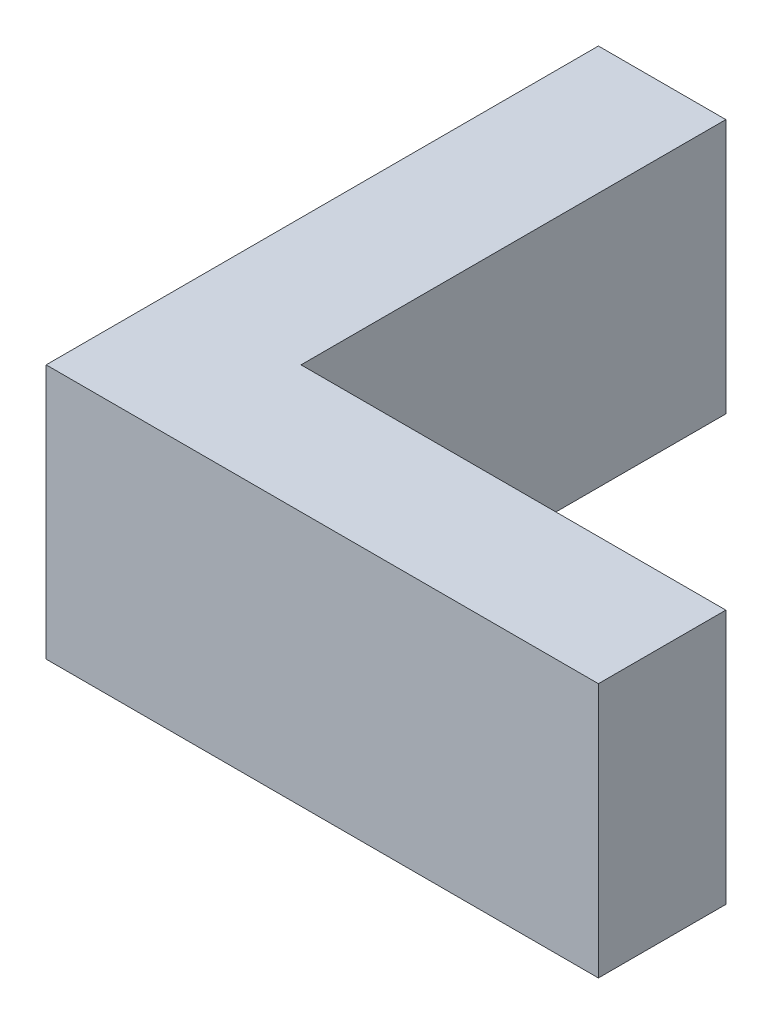
ISO-10303-21;
HEADER;
FILE_DESCRIPTION(('STEP AP214'),'2;1');
FILE_NAME('part.step','',(''),(''),'','','');
FILE_SCHEMA(('AUTOMOTIVE_DESIGN { 1 0 10303 214 1 1 1 1 }'));
ENDSEC;
DATA;
#1=APPLICATION_CONTEXT('core data for automotive mechanical design processes');
#2=APPLICATION_PROTOCOL_DEFINITION('international standard','automotive_design',2000,#1);
#3=PRODUCT_CONTEXT('',#1,'mechanical');
#4=PRODUCT('Part','Part','',(#3));
#5=PRODUCT_RELATED_PRODUCT_CATEGORY('part','',(#4));
#6=PRODUCT_DEFINITION_FORMATION('','',#4);
#7=PRODUCT_DEFINITION_CONTEXT('part definition',#1,'design');
#8=PRODUCT_DEFINITION('design','',#6,#7);
#9=PRODUCT_DEFINITION_SHAPE('','',#8);
#10=(LENGTH_UNIT() NAMED_UNIT(*) SI_UNIT(.MILLI.,.METRE.));
#11=(NAMED_UNIT(*) PLANE_ANGLE_UNIT() SI_UNIT($,.RADIAN.));
#12=(NAMED_UNIT(*) SI_UNIT($,.STERADIAN.) SOLID_ANGLE_UNIT());
#13=UNCERTAINTY_MEASURE_WITH_UNIT(LENGTH_MEASURE(1.E-05),#10,'distance_accuracy_value','');
#14=(GEOMETRIC_REPRESENTATION_CONTEXT(3) GLOBAL_UNCERTAINTY_ASSIGNED_CONTEXT((#13)) GLOBAL_UNIT_ASSIGNED_CONTEXT((#10,
#11,#12)) REPRESENTATION_CONTEXT('',''));
#15=CARTESIAN_POINT('',(0.,0.,0.));
#16=DIRECTION('',(0.,0.,1.));
#17=DIRECTION('',(1.,0.,0.));
#18=AXIS2_PLACEMENT_3D('',#15,#16,#17);
#19=CARTESIAN_POINT('',(20.,12.,0.));
#20=DIRECTION('',(0.,0.,1.));
#21=DIRECTION('',(1.,0.,0.));
#22=AXIS2_PLACEMENT_3D('',#19,#20,#21);
#23=PLANE('',#22);
#24=DIRECTION('',(-1.,0.,0.));
#25=VECTOR('',#24,1.);
#26=CARTESIAN_POINT('',(20.,0.,0.));
#27=LINE('',#26,#25);
#28=CARTESIAN_POINT('',(20.,0.,0.));
#29=VERTEX_POINT('',#28);
#30=CARTESIAN_POINT('',(0.,0.,0.));
#31=VERTEX_POINT('',#30);
#32=EDGE_CURVE('E117',#29,#31,#27,.T.);
#33=ORIENTED_EDGE('',*,*,#32,.T.);
#34=DIRECTION('',(0.,-1.,0.));
#35=VECTOR('',#34,1.);
#36=CARTESIAN_POINT('',(0.,12.,0.));
#37=LINE('',#36,#35);
#38=CARTESIAN_POINT('',(0.,12.,0.));
#39=VERTEX_POINT('',#38);
#40=EDGE_CURVE('E11',#39,#31,#37,.T.);
#41=ORIENTED_EDGE('',*,*,#40,.F.);
#42=DIRECTION('',(-1.,0.,0.));
#43=VECTOR('',#42,1.);
#44=CARTESIAN_POINT('',(20.,12.,0.));
#45=LINE('',#44,#43);
#46=CARTESIAN_POINT('',(20.,12.,0.));
#47=VERTEX_POINT('',#46);
#48=EDGE_CURVE('E127',#47,#39,#45,.T.);
#49=ORIENTED_EDGE('',*,*,#48,.F.);
#50=DIRECTION('',(0.,-1.,0.));
#51=VECTOR('',#50,1.);
#52=CARTESIAN_POINT('',(20.,12.,0.));
#53=LINE('',#52,#51);
#54=EDGE_CURVE('E113',#47,#29,#53,.T.);
#55=ORIENTED_EDGE('',*,*,#54,.T.);
#56=EDGE_LOOP('',(#33,#41,#49,#55));
#57=FACE_BOUND('',#56,.T.);
#58=ADVANCED_FACE('F33',(#57),#23,.F.);
#59=CARTESIAN_POINT('',(0.,12.,0.));
#60=DIRECTION('',(-1.,0.,0.));
#61=DIRECTION('',(0.,0.,1.));
#62=AXIS2_PLACEMENT_3D('',#59,#60,#61);
#63=PLANE('',#62);
#64=DIRECTION('',(0.,0.,-1.));
#65=VECTOR('',#64,1.);
#66=CARTESIAN_POINT('',(0.,0.,0.));
#67=LINE('',#66,#65);
#68=CARTESIAN_POINT('',(0.,0.,-20.));
#69=VERTEX_POINT('',#68);
#70=EDGE_CURVE('E120',#31,#69,#67,.T.);
#71=ORIENTED_EDGE('',*,*,#70,.T.);
#72=DIRECTION('',(0.,-1.,0.));
#73=VECTOR('',#72,1.);
#74=CARTESIAN_POINT('',(0.,12.,-20.));
#75=LINE('',#74,#73);
#76=CARTESIAN_POINT('',(0.,12.,-20.));
#77=VERTEX_POINT('',#76);
#78=EDGE_CURVE('E41',#77,#69,#75,.T.);
#79=ORIENTED_EDGE('',*,*,#78,.F.);
#80=DIRECTION('',(0.,0.,-1.));
#81=VECTOR('',#80,1.);
#82=CARTESIAN_POINT('',(0.,12.,0.));
#83=LINE('',#82,#81);
#84=EDGE_CURVE('E86',#39,#77,#83,.T.);
#85=ORIENTED_EDGE('',*,*,#84,.F.);
#86=ORIENTED_EDGE('',*,*,#40,.T.);
#87=EDGE_LOOP('',(#71,#79,#85,#86));
#88=FACE_BOUND('',#87,.T.);
#89=ADVANCED_FACE('F151',(#88),#63,.F.);
#90=CARTESIAN_POINT('',(0.,12.,-20.));
#91=DIRECTION('',(0.,0.,1.));
#92=DIRECTION('',(1.,0.,0.));
#93=AXIS2_PLACEMENT_3D('',#90,#91,#92);
#94=PLANE('',#93);
#95=DIRECTION('',(-1.,0.,0.));
#96=VECTOR('',#95,1.);
#97=CARTESIAN_POINT('',(0.,0.,-20.));
#98=LINE('',#97,#96);
#99=CARTESIAN_POINT('',(-6.,0.,-20.));
#100=VERTEX_POINT('',#99);
#101=EDGE_CURVE('E122',#69,#100,#98,.T.);
#102=ORIENTED_EDGE('',*,*,#101,.T.);
#103=DIRECTION('',(0.,-1.,0.));
#104=VECTOR('',#103,1.);
#105=CARTESIAN_POINT('',(-6.,12.,-20.));
#106=LINE('',#105,#104);
#107=CARTESIAN_POINT('',(-6.,12.,-20.));
#108=VERTEX_POINT('',#107);
#109=EDGE_CURVE('E108',#108,#100,#106,.T.);
#110=ORIENTED_EDGE('',*,*,#109,.F.);
#111=DIRECTION('',(-1.,0.,0.));
#112=VECTOR('',#111,1.);
#113=CARTESIAN_POINT('',(0.,12.,-20.));
#114=LINE('',#113,#112);
#115=EDGE_CURVE('E99',#77,#108,#114,.T.);
#116=ORIENTED_EDGE('',*,*,#115,.F.);
#117=ORIENTED_EDGE('',*,*,#78,.T.);
#118=EDGE_LOOP('',(#102,#110,#116,#117));
#119=FACE_BOUND('',#118,.T.);
#120=ADVANCED_FACE('F133',(#119),#94,.F.);
#121=CARTESIAN_POINT('',(-6.,12.,-20.));
#122=DIRECTION('',(1.,0.,0.));
#123=DIRECTION('',(0.,0.,-1.));
#124=AXIS2_PLACEMENT_3D('',#121,#122,#123);
#125=PLANE('',#124);
#126=DIRECTION('',(0.,0.,1.));
#127=VECTOR('',#126,1.);
#128=CARTESIAN_POINT('',(-6.,0.,-20.));
#129=LINE('',#128,#127);
#130=CARTESIAN_POINT('',(-6.,0.,6.));
#131=VERTEX_POINT('',#130);
#132=EDGE_CURVE('E107',#100,#131,#129,.T.);
#133=ORIENTED_EDGE('',*,*,#132,.T.);
#134=DIRECTION('',(0.,-1.,0.));
#135=VECTOR('',#134,1.);
#136=CARTESIAN_POINT('',(-6.,12.,6.));
#137=LINE('',#136,#135);
#138=CARTESIAN_POINT('',(-6.,12.,6.));
#139=VERTEX_POINT('',#138);
#140=EDGE_CURVE('E104',#139,#131,#137,.T.);
#141=ORIENTED_EDGE('',*,*,#140,.F.);
#142=DIRECTION('',(0.,0.,1.));
#143=VECTOR('',#142,1.);
#144=CARTESIAN_POINT('',(-6.,12.,-20.));
#145=LINE('',#144,#143);
#146=EDGE_CURVE('E93',#108,#139,#145,.T.);
#147=ORIENTED_EDGE('',*,*,#146,.F.);
#148=ORIENTED_EDGE('',*,*,#109,.T.);
#149=EDGE_LOOP('',(#133,#141,#147,#148));
#150=FACE_BOUND('',#149,.T.);
#151=ADVANCED_FACE('F105',(#150),#125,.F.);
#152=CARTESIAN_POINT('',(-6.,12.,6.));
#153=DIRECTION('',(0.,0.,-1.));
#154=DIRECTION('',(-1.,0.,0.));
#155=AXIS2_PLACEMENT_3D('',#152,#153,#154);
#156=PLANE('',#155);
#157=DIRECTION('',(1.,0.,0.));
#158=VECTOR('',#157,1.);
#159=CARTESIAN_POINT('',(-6.,0.,6.));
#160=LINE('',#159,#158);
#161=CARTESIAN_POINT('',(20.,0.,6.));
#162=VERTEX_POINT('',#161);
#163=EDGE_CURVE('E72',#131,#162,#160,.T.);
#164=ORIENTED_EDGE('',*,*,#163,.T.);
#165=DIRECTION('',(0.,-1.,0.));
#166=VECTOR('',#165,1.);
#167=CARTESIAN_POINT('',(20.,12.,6.));
#168=LINE('',#167,#166);
#169=CARTESIAN_POINT('',(20.,12.,6.));
#170=VERTEX_POINT('',#169);
#171=EDGE_CURVE('E109',#170,#162,#168,.T.);
#172=ORIENTED_EDGE('',*,*,#171,.F.);
#173=DIRECTION('',(1.,0.,0.));
#174=VECTOR('',#173,1.);
#175=CARTESIAN_POINT('',(-6.,12.,6.));
#176=LINE('',#175,#174);
#177=EDGE_CURVE('E97',#139,#170,#176,.T.);
#178=ORIENTED_EDGE('',*,*,#177,.F.);
#179=ORIENTED_EDGE('',*,*,#140,.T.);
#180=EDGE_LOOP('',(#164,#172,#178,#179));
#181=FACE_BOUND('',#180,.T.);
#182=ADVANCED_FACE('F111',(#181),#156,.F.);
#183=CARTESIAN_POINT('',(20.,12.,6.));
#184=DIRECTION('',(-1.,0.,0.));
#185=DIRECTION('',(0.,0.,1.));
#186=AXIS2_PLACEMENT_3D('',#183,#184,#185);
#187=PLANE('',#186);
#188=DIRECTION('',(0.,0.,-1.));
#189=VECTOR('',#188,1.);
#190=CARTESIAN_POINT('',(20.,0.,6.));
#191=LINE('',#190,#189);
#192=EDGE_CURVE('E78',#162,#29,#191,.T.);
#193=ORIENTED_EDGE('',*,*,#192,.T.);
#194=ORIENTED_EDGE('',*,*,#54,.F.);
#195=DIRECTION('',(0.,0.,-1.));
#196=VECTOR('',#195,1.);
#197=CARTESIAN_POINT('',(20.,12.,6.));
#198=LINE('',#197,#196);
#199=EDGE_CURVE('E49',#170,#47,#198,.T.);
#200=ORIENTED_EDGE('',*,*,#199,.F.);
#201=ORIENTED_EDGE('',*,*,#171,.T.);
#202=EDGE_LOOP('',(#193,#194,#200,#201));
#203=FACE_BOUND('',#202,.T.);
#204=ADVANCED_FACE('F140',(#203),#187,.F.);
#205=CARTESIAN_POINT('',(0.,12.,0.));
#206=DIRECTION('',(0.,-1.,0.));
#207=DIRECTION('',(0.,0.,-1.));
#208=AXIS2_PLACEMENT_3D('',#205,#206,#207);
#209=PLANE('',#208);
#210=ORIENTED_EDGE('',*,*,#48,.T.);
#211=ORIENTED_EDGE('',*,*,#84,.T.);
#212=ORIENTED_EDGE('',*,*,#115,.T.);
#213=ORIENTED_EDGE('',*,*,#146,.T.);
#214=ORIENTED_EDGE('',*,*,#177,.T.);
#215=ORIENTED_EDGE('',*,*,#199,.T.);
#216=EDGE_LOOP('',(#210,#211,#212,#213,#214,#215));
#217=FACE_BOUND('',#216,.T.);
#218=ADVANCED_FACE('F95',(#217),#209,.F.);
#219=CARTESIAN_POINT('',(0.,0.,0.));
#220=DIRECTION('',(0.,-1.,0.));
#221=DIRECTION('',(0.,0.,-1.));
#222=AXIS2_PLACEMENT_3D('',#219,#220,#221);
#223=PLANE('',#222);
#224=ORIENTED_EDGE('',*,*,#32,.F.);
#225=ORIENTED_EDGE('',*,*,#192,.F.);
#226=ORIENTED_EDGE('',*,*,#163,.F.);
#227=ORIENTED_EDGE('',*,*,#132,.F.);
#228=ORIENTED_EDGE('',*,*,#101,.F.);
#229=ORIENTED_EDGE('',*,*,#70,.F.);
#230=EDGE_LOOP('',(#224,#225,#226,#227,#228,#229));
#231=FACE_BOUND('',#230,.T.);
#232=ADVANCED_FACE('F136',(#231),#223,.T.);
#233=CLOSED_SHELL('',(#58,#89,#120,#151,#182,#204,#218,#232));
#234=MANIFOLD_SOLID_BREP('B2',#233);
#235=ADVANCED_BREP_SHAPE_REPRESENTATION('',(#18,#234),#14);
#236=SHAPE_DEFINITION_REPRESENTATION(#9,#235);
ENDSEC;
END-ISO-10303-21;
